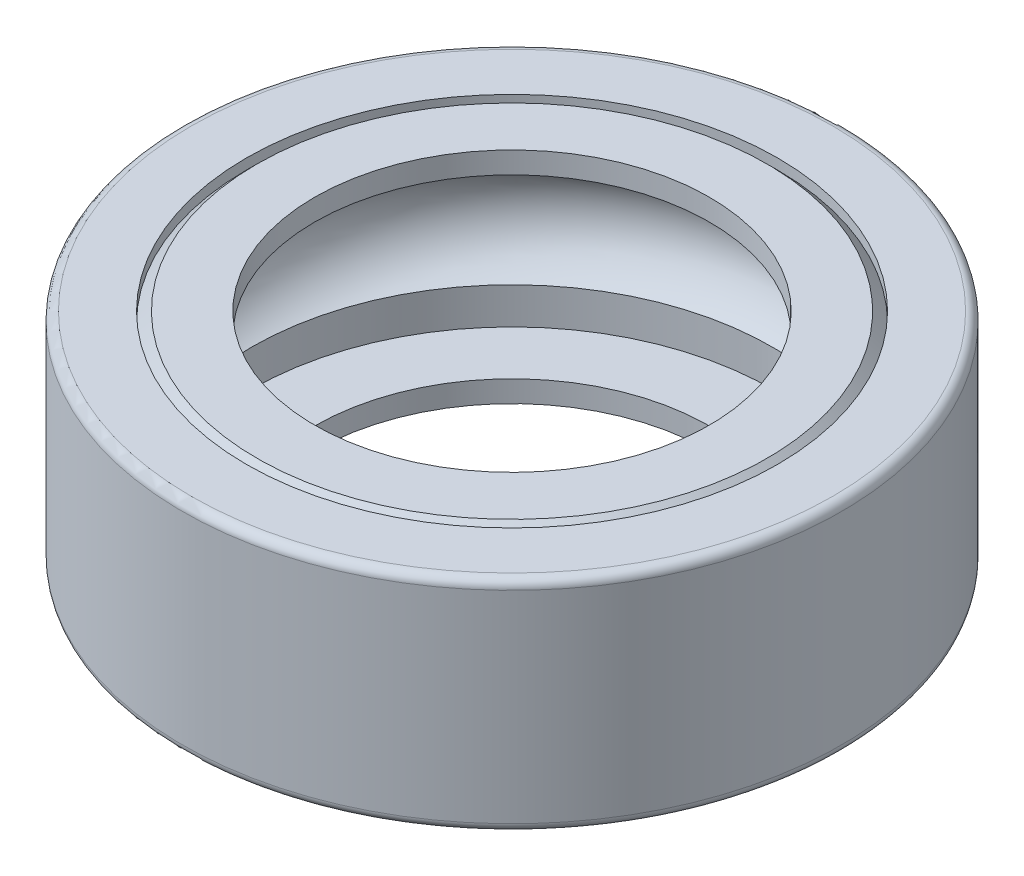
ISO-10303-21;
HEADER;
FILE_DESCRIPTION(('STEP AP214'),'2;1');
FILE_NAME('part.step','',(''),(''),'','','');
FILE_SCHEMA(('AUTOMOTIVE_DESIGN { 1 0 10303 214 1 1 1 1 }'));
ENDSEC;
DATA;
#1=APPLICATION_CONTEXT('core data for automotive mechanical design processes');
#2=APPLICATION_PROTOCOL_DEFINITION('international standard','automotive_design',2000,#1);
#3=PRODUCT_CONTEXT('',#1,'mechanical');
#4=PRODUCT('Part','Part','',(#3));
#5=PRODUCT_RELATED_PRODUCT_CATEGORY('part','',(#4));
#6=PRODUCT_DEFINITION_FORMATION('','',#4);
#7=PRODUCT_DEFINITION_CONTEXT('part definition',#1,'design');
#8=PRODUCT_DEFINITION('design','',#6,#7);
#9=PRODUCT_DEFINITION_SHAPE('','',#8);
#10=(LENGTH_UNIT() NAMED_UNIT(*) SI_UNIT(.MILLI.,.METRE.));
#11=(NAMED_UNIT(*) PLANE_ANGLE_UNIT() SI_UNIT($,.RADIAN.));
#12=(NAMED_UNIT(*) SI_UNIT($,.STERADIAN.) SOLID_ANGLE_UNIT());
#13=UNCERTAINTY_MEASURE_WITH_UNIT(LENGTH_MEASURE(1.E-05),#10,'distance_accuracy_value','');
#14=(GEOMETRIC_REPRESENTATION_CONTEXT(3) GLOBAL_UNCERTAINTY_ASSIGNED_CONTEXT((#13)) GLOBAL_UNIT_ASSIGNED_CONTEXT((#10,
#11,#12)) REPRESENTATION_CONTEXT('',''));
#15=CARTESIAN_POINT('',(0.,0.,0.));
#16=DIRECTION('',(0.,0.,1.));
#17=DIRECTION('',(1.,0.,0.));
#18=AXIS2_PLACEMENT_3D('',#15,#16,#17);
#19=CARTESIAN_POINT('',(6.04350000000431,-4.49999999995202,0.));
#20=DIRECTION('',(0.,-1.,0.));
#21=DIRECTION('',(1.,0.,0.));
#22=AXIS2_PLACEMENT_3D('',#19,#20,#21);
#23=PLANE('',#22);
#24=CARTESIAN_POINT('',(0.,-4.49999999995202,0.));
#25=DIRECTION('',(0.,1.,0.));
#26=DIRECTION('',(-1.,0.,0.));
#27=AXIS2_PLACEMENT_3D('',#24,#25,#26);
#28=CIRCLE('',#27,5.925);
#29=CARTESIAN_POINT('',(-5.925,-4.49999999995202,0.));
#30=VERTEX_POINT('',#29);
#31=EDGE_CURVE('E100',#30,#30,#28,.T.);
#32=ORIENTED_EDGE('',*,*,#31,.T.);
#33=EDGE_LOOP('',(#32));
#34=FACE_BOUND('',#33,.T.);
#35=CARTESIAN_POINT('',(0.,-4.49999999995202,0.));
#36=DIRECTION('',(0.,1.,0.));
#37=DIRECTION('',(-1.,0.,0.));
#38=AXIS2_PLACEMENT_3D('',#35,#36,#37);
#39=CIRCLE('',#38,6.04350000000431);
#40=CARTESIAN_POINT('',(-6.04350000000432,-4.49999999995202,0.));
#41=VERTEX_POINT('',#40);
#42=EDGE_CURVE('E10',#41,#41,#39,.T.);
#43=ORIENTED_EDGE('',*,*,#42,.F.);
#44=EDGE_LOOP('',(#43));
#45=FACE_BOUND('',#44,.T.);
#46=ADVANCED_FACE('F30',(#34,#45),#23,.T.);
#47=CARTESIAN_POINT('',(0.,-5.00125000192031,0.));
#48=DIRECTION('',(0.,1.,0.));
#49=DIRECTION('',(-1.,0.,0.));
#50=AXIS2_PLACEMENT_3D('',#47,#48,#49);
#51=CYLINDRICAL_SURFACE('',#50,6.04350000000431);
#52=ORIENTED_EDGE('',*,*,#42,.T.);
#53=EDGE_LOOP('',(#52));
#54=FACE_BOUND('',#53,.T.);
#55=CARTESIAN_POINT('',(0.,-4.50999999995202,0.));
#56=DIRECTION('',(0.,1.,0.));
#57=DIRECTION('',(-1.,0.,0.));
#58=AXIS2_PLACEMENT_3D('',#55,#56,#57);
#59=CIRCLE('',#58,6.04350000000431);
#60=CARTESIAN_POINT('',(-6.04350000000432,-4.50999999995202,0.));
#61=VERTEX_POINT('',#60);
#62=EDGE_CURVE('E36',#61,#61,#59,.T.);
#63=ORIENTED_EDGE('',*,*,#62,.F.);
#64=EDGE_LOOP('',(#63));
#65=FACE_BOUND('',#64,.T.);
#66=ADVANCED_FACE('F118',(#54,#65),#51,.F.);
#67=CARTESIAN_POINT('',(4.4935,-4.50999999995202,0.));
#68=DIRECTION('',(0.,1.,0.));
#69=DIRECTION('',(-1.,0.,0.));
#70=AXIS2_PLACEMENT_3D('',#67,#68,#69);
#71=PLANE('',#70);
#72=ORIENTED_EDGE('',*,*,#62,.T.);
#73=EDGE_LOOP('',(#72));
#74=FACE_BOUND('',#73,.T.);
#75=CARTESIAN_POINT('',(0.,-4.50999999995202,0.));
#76=DIRECTION('',(0.,1.,0.));
#77=DIRECTION('',(-1.,0.,0.));
#78=AXIS2_PLACEMENT_3D('',#75,#76,#77);
#79=CIRCLE('',#78,4.4935);
#80=CARTESIAN_POINT('',(-4.4935,-4.50999999995202,0.));
#81=VERTEX_POINT('',#80);
#82=EDGE_CURVE('E40',#81,#81,#79,.T.);
#83=ORIENTED_EDGE('',*,*,#82,.F.);
#84=EDGE_LOOP('',(#83));
#85=FACE_BOUND('',#84,.T.);
#86=ADVANCED_FACE('F122',(#74,#85),#71,.T.);
#87=CARTESIAN_POINT('',(0.,-5.00125000192031,0.));
#88=DIRECTION('',(0.,1.,0.));
#89=DIRECTION('',(-1.,0.,0.));
#90=AXIS2_PLACEMENT_3D('',#87,#88,#89);
#91=CYLINDRICAL_SURFACE('',#90,4.4935);
#92=ORIENTED_EDGE('',*,*,#82,.T.);
#93=EDGE_LOOP('',(#92));
#94=FACE_BOUND('',#93,.T.);
#95=CARTESIAN_POINT('',(0.,-5.,0.));
#96=DIRECTION('',(0.,1.,0.));
#97=DIRECTION('',(-1.,0.,0.));
#98=AXIS2_PLACEMENT_3D('',#95,#96,#97);
#99=CIRCLE('',#98,4.4935);
#100=CARTESIAN_POINT('',(-4.4935,-5.,0.));
#101=VERTEX_POINT('',#100);
#102=EDGE_CURVE('E44',#101,#101,#99,.T.);
#103=ORIENTED_EDGE('',*,*,#102,.F.);
#104=EDGE_LOOP('',(#103));
#105=FACE_BOUND('',#104,.T.);
#106=ADVANCED_FACE('F126',(#94,#105),#91,.F.);
#107=CARTESIAN_POINT('',(5.80349999995633,-5.,0.));
#108=DIRECTION('',(0.,-1.,0.));
#109=DIRECTION('',(1.,0.,0.));
#110=AXIS2_PLACEMENT_3D('',#107,#108,#109);
#111=PLANE('',#110);
#112=ORIENTED_EDGE('',*,*,#102,.T.);
#113=EDGE_LOOP('',(#112));
#114=FACE_BOUND('',#113,.T.);
#115=CARTESIAN_POINT('',(0.,-5.,0.));
#116=DIRECTION('',(0.,1.,0.));
#117=DIRECTION('',(-1.,0.,0.));
#118=AXIS2_PLACEMENT_3D('',#115,#116,#117);
#119=CIRCLE('',#118,5.80349999995633);
#120=CARTESIAN_POINT('',(-5.80349999995633,-5.,0.));
#121=VERTEX_POINT('',#120);
#122=EDGE_CURVE('E49',#121,#121,#119,.T.);
#123=ORIENTED_EDGE('',*,*,#122,.F.);
#124=EDGE_LOOP('',(#123));
#125=FACE_BOUND('',#124,.T.);
#126=ADVANCED_FACE('F132',(#114,#125),#111,.T.);
#127=CARTESIAN_POINT('',(0.,-4.75999999995202,0.));
#128=DIRECTION('',(0.,1.,0.));
#129=DIRECTION('',(-1.,0.,0.));
#130=AXIS2_PLACEMENT_3D('',#127,#128,#129);
#131=CONICAL_SURFACE('',#130,6.04350000000431,0.78539816339745);
#132=ORIENTED_EDGE('',*,*,#122,.T.);
#133=EDGE_LOOP('',(#132));
#134=FACE_BOUND('',#133,.T.);
#135=CARTESIAN_POINT('',(0.,-4.75999999995202,0.));
#136=DIRECTION('',(0.,1.,0.));
#137=DIRECTION('',(-1.,0.,0.));
#138=AXIS2_PLACEMENT_3D('',#135,#136,#137);
#139=CIRCLE('',#138,6.04350000000431);
#140=CARTESIAN_POINT('',(-6.04350000000432,-4.75999999995202,0.));
#141=VERTEX_POINT('',#140);
#142=EDGE_CURVE('E52',#141,#141,#139,.T.);
#143=ORIENTED_EDGE('',*,*,#142,.F.);
#144=EDGE_LOOP('',(#143));
#145=FACE_BOUND('',#144,.T.);
#146=ADVANCED_FACE('F136',(#134,#145),#131,.T.);
#147=CARTESIAN_POINT('',(0.,-5.00125000192031,0.));
#148=DIRECTION('',(0.,1.,0.));
#149=DIRECTION('',(-1.,0.,0.));
#150=AXIS2_PLACEMENT_3D('',#147,#148,#149);
#151=CYLINDRICAL_SURFACE('',#150,6.04350000000431);
#152=ORIENTED_EDGE('',*,*,#142,.T.);
#153=EDGE_LOOP('',(#152));
#154=FACE_BOUND('',#153,.T.);
#155=CARTESIAN_POINT('',(0.,-5.,0.));
#156=DIRECTION('',(0.,1.,0.));
#157=DIRECTION('',(-1.,0.,0.));
#158=AXIS2_PLACEMENT_3D('',#155,#156,#157);
#159=CIRCLE('',#158,6.04350000000431);
#160=CARTESIAN_POINT('',(-6.04350000000432,-5.,0.));
#161=VERTEX_POINT('',#160);
#162=EDGE_CURVE('E55',#161,#161,#159,.T.);
#163=ORIENTED_EDGE('',*,*,#162,.F.);
#164=EDGE_LOOP('',(#163));
#165=FACE_BOUND('',#164,.T.);
#166=ADVANCED_FACE('F140',(#154,#165),#151,.F.);
#167=CARTESIAN_POINT('',(7.3,-5.,0.));
#168=DIRECTION('',(0.,-1.,0.));
#169=DIRECTION('',(1.,0.,0.));
#170=AXIS2_PLACEMENT_3D('',#167,#168,#169);
#171=PLANE('',#170);
#172=ORIENTED_EDGE('',*,*,#162,.T.);
#173=EDGE_LOOP('',(#172));
#174=FACE_BOUND('',#173,.T.);
#175=CARTESIAN_POINT('',(0.,-5.,0.));
#176=DIRECTION('',(0.,1.,0.));
#177=DIRECTION('',(-1.,0.,0.));
#178=AXIS2_PLACEMENT_3D('',#175,#176,#177);
#179=CIRCLE('',#178,7.3);
#180=CARTESIAN_POINT('',(-7.3,-5.,0.));
#181=VERTEX_POINT('',#180);
#182=EDGE_CURVE('E58',#181,#181,#179,.T.);
#183=ORIENTED_EDGE('',*,*,#182,.F.);
#184=EDGE_LOOP('',(#183));
#185=FACE_BOUND('',#184,.T.);
#186=ADVANCED_FACE('F144',(#174,#185),#171,.T.);
#187=CARTESIAN_POINT('',(0.,-4.8,0.));
#188=DIRECTION('',(0.,1.,0.));
#189=DIRECTION('',(-1.,0.,0.));
#190=AXIS2_PLACEMENT_3D('',#187,#188,#189);
#191=TOROIDAL_SURFACE('',#190,7.3,0.200000000000001);
#192=ORIENTED_EDGE('',*,*,#182,.T.);
#193=EDGE_LOOP('',(#192));
#194=FACE_BOUND('',#193,.T.);
#195=CARTESIAN_POINT('',(0.,-4.8,0.));
#196=DIRECTION('',(0.,1.,0.));
#197=DIRECTION('',(-1.,0.,0.));
#198=AXIS2_PLACEMENT_3D('',#195,#196,#197);
#199=CIRCLE('',#198,7.5);
#200=CARTESIAN_POINT('',(-7.5,-4.79999999999999,0.));
#201=VERTEX_POINT('',#200);
#202=EDGE_CURVE('E61',#201,#201,#199,.T.);
#203=ORIENTED_EDGE('',*,*,#202,.F.);
#204=EDGE_LOOP('',(#203));
#205=FACE_BOUND('',#204,.T.);
#206=ADVANCED_FACE('F148',(#194,#205),#191,.T.);
#207=CARTESIAN_POINT('',(0.,-5.00125000192031,0.));
#208=DIRECTION('',(0.,1.,0.));
#209=DIRECTION('',(-1.,0.,0.));
#210=AXIS2_PLACEMENT_3D('',#207,#208,#209);
#211=CYLINDRICAL_SURFACE('',#210,7.5);
#212=ORIENTED_EDGE('',*,*,#202,.T.);
#213=EDGE_LOOP('',(#212));
#214=FACE_BOUND('',#213,.T.);
#215=CARTESIAN_POINT('',(0.,-0.199999999901764,0.));
#216=DIRECTION('',(0.,1.,0.));
#217=DIRECTION('',(-1.,0.,0.));
#218=AXIS2_PLACEMENT_3D('',#215,#216,#217);
#219=CIRCLE('',#218,7.5);
#220=CARTESIAN_POINT('',(-7.5,-0.199999999901763,0.));
#221=VERTEX_POINT('',#220);
#222=EDGE_CURVE('E64',#221,#221,#219,.T.);
#223=ORIENTED_EDGE('',*,*,#222,.F.);
#224=EDGE_LOOP('',(#223));
#225=FACE_BOUND('',#224,.T.);
#226=ADVANCED_FACE('F152',(#214,#225),#211,.T.);
#227=CARTESIAN_POINT('',(0.,-0.199999999901764,0.));
#228=DIRECTION('',(0.,1.,0.));
#229=DIRECTION('',(-1.,0.,0.));
#230=AXIS2_PLACEMENT_3D('',#227,#228,#229);
#231=TOROIDAL_SURFACE('',#230,7.3,0.200000000000001);
#232=ORIENTED_EDGE('',*,*,#222,.T.);
#233=EDGE_LOOP('',(#232));
#234=FACE_BOUND('',#233,.T.);
#235=CARTESIAN_POINT('',(0.,9.82365230828286E-11,0.));
#236=DIRECTION('',(0.,1.,0.));
#237=DIRECTION('',(-1.,0.,0.));
#238=AXIS2_PLACEMENT_3D('',#235,#236,#237);
#239=CIRCLE('',#238,7.3);
#240=CARTESIAN_POINT('',(-7.3,9.8237864026786E-11,0.));
#241=VERTEX_POINT('',#240);
#242=EDGE_CURVE('E67',#241,#241,#239,.T.);
#243=ORIENTED_EDGE('',*,*,#242,.F.);
#244=EDGE_LOOP('',(#243));
#245=FACE_BOUND('',#244,.T.);
#246=ADVANCED_FACE('F156',(#234,#245),#231,.T.);
#247=CARTESIAN_POINT('',(6.04350000000431,9.82352019187913E-11,0.));
#248=DIRECTION('',(0.,1.,0.));
#249=DIRECTION('',(-1.,0.,0.));
#250=AXIS2_PLACEMENT_3D('',#247,#248,#249);
#251=PLANE('',#250);
#252=ORIENTED_EDGE('',*,*,#242,.T.);
#253=EDGE_LOOP('',(#252));
#254=FACE_BOUND('',#253,.T.);
#255=CARTESIAN_POINT('',(0.,9.82356557210906E-11,0.));
#256=DIRECTION('',(0.,1.,0.));
#257=DIRECTION('',(-1.,0.,0.));
#258=AXIS2_PLACEMENT_3D('',#255,#256,#257);
#259=CIRCLE('',#258,6.04350000000431);
#260=CARTESIAN_POINT('',(-6.04350000000431,9.82367658573655E-11,0.));
#261=VERTEX_POINT('',#260);
#262=EDGE_CURVE('E70',#261,#261,#259,.T.);
#263=ORIENTED_EDGE('',*,*,#262,.F.);
#264=EDGE_LOOP('',(#263));
#265=FACE_BOUND('',#264,.T.);
#266=ADVANCED_FACE('F160',(#254,#265),#251,.T.);
#267=CARTESIAN_POINT('',(0.,-5.00125000192031,0.));
#268=DIRECTION('',(0.,1.,0.));
#269=DIRECTION('',(-1.,0.,0.));
#270=AXIS2_PLACEMENT_3D('',#267,#268,#269);
#271=CYLINDRICAL_SURFACE('',#270,6.04350000000431);
#272=ORIENTED_EDGE('',*,*,#262,.T.);
#273=EDGE_LOOP('',(#272));
#274=FACE_BOUND('',#273,.T.);
#275=CARTESIAN_POINT('',(0.,-0.239999999952019,0.));
#276=DIRECTION('',(0.,1.,0.));
#277=DIRECTION('',(-1.,0.,0.));
#278=AXIS2_PLACEMENT_3D('',#275,#276,#277);
#279=CIRCLE('',#278,6.04350000000431);
#280=CARTESIAN_POINT('',(-6.04350000000431,-0.239999999952018,0.));
#281=VERTEX_POINT('',#280);
#282=EDGE_CURVE('E73',#281,#281,#279,.T.);
#283=ORIENTED_EDGE('',*,*,#282,.F.);
#284=EDGE_LOOP('',(#283));
#285=FACE_BOUND('',#284,.T.);
#286=ADVANCED_FACE('F164',(#274,#285),#271,.F.);
#287=CARTESIAN_POINT('',(0.,9.82356557210906E-11,0.));
#288=DIRECTION('',(0.,-1.,0.));
#289=DIRECTION('',(1.,0.,0.));
#290=AXIS2_PLACEMENT_3D('',#287,#288,#289);
#291=CONICAL_SURFACE('',#290,5.80349999995406,0.785398163397452);
#292=ORIENTED_EDGE('',*,*,#282,.T.);
#293=EDGE_LOOP('',(#292));
#294=FACE_BOUND('',#293,.T.);
#295=CARTESIAN_POINT('',(0.,9.82356557210906E-11,0.));
#296=DIRECTION('',(0.,1.,0.));
#297=DIRECTION('',(-1.,0.,0.));
#298=AXIS2_PLACEMENT_3D('',#295,#296,#297);
#299=CIRCLE('',#298,5.80349999995406);
#300=CARTESIAN_POINT('',(-5.80349999995406,9.82367217715368E-11,0.));
#301=VERTEX_POINT('',#300);
#302=EDGE_CURVE('E76',#301,#301,#299,.T.);
#303=ORIENTED_EDGE('',*,*,#302,.F.);
#304=EDGE_LOOP('',(#303));
#305=FACE_BOUND('',#304,.T.);
#306=ADVANCED_FACE('F168',(#294,#305),#291,.T.);
#307=CARTESIAN_POINT('',(4.4935,9.82354103392009E-11,0.));
#308=DIRECTION('',(0.,1.,0.));
#309=DIRECTION('',(-1.,0.,0.));
#310=AXIS2_PLACEMENT_3D('',#307,#308,#309);
#311=PLANE('',#310);
#312=ORIENTED_EDGE('',*,*,#302,.T.);
#313=EDGE_LOOP('',(#312));
#314=FACE_BOUND('',#313,.T.);
#315=CARTESIAN_POINT('',(0.,9.82365230828286E-11,0.));
#316=DIRECTION('',(0.,1.,0.));
#317=DIRECTION('',(-1.,0.,0.));
#318=AXIS2_PLACEMENT_3D('',#315,#316,#317);
#319=CIRCLE('',#318,4.4935);
#320=CARTESIAN_POINT('',(-4.4935,9.82373484981262E-11,0.));
#321=VERTEX_POINT('',#320);
#322=EDGE_CURVE('E79',#321,#321,#319,.T.);
#323=ORIENTED_EDGE('',*,*,#322,.F.);
#324=EDGE_LOOP('',(#323));
#325=FACE_BOUND('',#324,.T.);
#326=ADVANCED_FACE('F172',(#314,#325),#311,.T.);
#327=CARTESIAN_POINT('',(0.,-5.00125000192031,0.));
#328=DIRECTION('',(0.,1.,0.));
#329=DIRECTION('',(-1.,0.,0.));
#330=AXIS2_PLACEMENT_3D('',#327,#328,#329);
#331=CYLINDRICAL_SURFACE('',#330,4.4935);
#332=ORIENTED_EDGE('',*,*,#322,.T.);
#333=EDGE_LOOP('',(#332));
#334=FACE_BOUND('',#333,.T.);
#335=CARTESIAN_POINT('',(0.,-0.489999999952023,0.));
#336=DIRECTION('',(0.,1.,0.));
#337=DIRECTION('',(-1.,0.,0.));
#338=AXIS2_PLACEMENT_3D('',#335,#336,#337);
#339=CIRCLE('',#338,4.4935);
#340=CARTESIAN_POINT('',(-4.4935,-0.489999999952022,0.));
#341=VERTEX_POINT('',#340);
#342=EDGE_CURVE('E82',#341,#341,#339,.T.);
#343=ORIENTED_EDGE('',*,*,#342,.F.);
#344=EDGE_LOOP('',(#343));
#345=FACE_BOUND('',#344,.T.);
#346=ADVANCED_FACE('F176',(#334,#345),#331,.F.);
#347=CARTESIAN_POINT('',(6.04350000000431,-0.489999999952024,0.));
#348=DIRECTION('',(0.,-1.,0.));
#349=DIRECTION('',(1.,0.,0.));
#350=AXIS2_PLACEMENT_3D('',#347,#348,#349);
#351=PLANE('',#350);
#352=ORIENTED_EDGE('',*,*,#342,.T.);
#353=EDGE_LOOP('',(#352));
#354=FACE_BOUND('',#353,.T.);
#355=CARTESIAN_POINT('',(0.,-0.489999999952023,0.));
#356=DIRECTION('',(0.,1.,0.));
#357=DIRECTION('',(-1.,0.,0.));
#358=AXIS2_PLACEMENT_3D('',#355,#356,#357);
#359=CIRCLE('',#358,6.04350000000431);
#360=CARTESIAN_POINT('',(-6.04350000000431,-0.489999999952022,0.));
#361=VERTEX_POINT('',#360);
#362=EDGE_CURVE('E85',#361,#361,#359,.T.);
#363=ORIENTED_EDGE('',*,*,#362,.F.);
#364=EDGE_LOOP('',(#363));
#365=FACE_BOUND('',#364,.T.);
#366=ADVANCED_FACE('F180',(#354,#365),#351,.T.);
#367=CARTESIAN_POINT('',(0.,-5.00125000192031,0.));
#368=DIRECTION('',(0.,1.,0.));
#369=DIRECTION('',(-1.,0.,0.));
#370=AXIS2_PLACEMENT_3D('',#367,#368,#369);
#371=CYLINDRICAL_SURFACE('',#370,6.04350000000431);
#372=ORIENTED_EDGE('',*,*,#362,.T.);
#373=EDGE_LOOP('',(#372));
#374=FACE_BOUND('',#373,.T.);
#375=CARTESIAN_POINT('',(0.,-0.49999999995202,0.));
#376=DIRECTION('',(0.,1.,0.));
#377=DIRECTION('',(-1.,0.,0.));
#378=AXIS2_PLACEMENT_3D('',#375,#376,#377);
#379=CIRCLE('',#378,6.04350000000431);
#380=CARTESIAN_POINT('',(-6.04350000000431,-0.499999999952019,0.));
#381=VERTEX_POINT('',#380);
#382=EDGE_CURVE('E88',#381,#381,#379,.T.);
#383=ORIENTED_EDGE('',*,*,#382,.F.);
#384=EDGE_LOOP('',(#383));
#385=FACE_BOUND('',#384,.T.);
#386=ADVANCED_FACE('F184',(#374,#385),#371,.F.);
#387=CARTESIAN_POINT('',(5.925,-0.49999999995202,0.));
#388=DIRECTION('',(0.,1.,0.));
#389=DIRECTION('',(-1.,0.,0.));
#390=AXIS2_PLACEMENT_3D('',#387,#388,#389);
#391=PLANE('',#390);
#392=ORIENTED_EDGE('',*,*,#382,.T.);
#393=EDGE_LOOP('',(#392));
#394=FACE_BOUND('',#393,.T.);
#395=CARTESIAN_POINT('',(0.,-0.49999999995202,0.));
#396=DIRECTION('',(0.,1.,0.));
#397=DIRECTION('',(-1.,0.,0.));
#398=AXIS2_PLACEMENT_3D('',#395,#396,#397);
#399=CIRCLE('',#398,5.925);
#400=CARTESIAN_POINT('',(-5.925,-0.499999999952019,0.));
#401=VERTEX_POINT('',#400);
#402=EDGE_CURVE('E91',#401,#401,#399,.T.);
#403=ORIENTED_EDGE('',*,*,#402,.F.);
#404=EDGE_LOOP('',(#403));
#405=FACE_BOUND('',#404,.T.);
#406=ADVANCED_FACE('F188',(#394,#405),#391,.T.);
#407=CARTESIAN_POINT('',(0.,-5.00125000192031,0.));
#408=DIRECTION('',(0.,1.,0.));
#409=DIRECTION('',(-1.,0.,0.));
#410=AXIS2_PLACEMENT_3D('',#407,#408,#409);
#411=CYLINDRICAL_SURFACE('',#410,5.925);
#412=ORIENTED_EDGE('',*,*,#402,.T.);
#413=EDGE_LOOP('',(#412));
#414=FACE_BOUND('',#413,.T.);
#415=CARTESIAN_POINT('',(0.,-1.33086570489101,0.));
#416=DIRECTION('',(0.,1.,0.));
#417=DIRECTION('',(-1.,0.,0.));
#418=AXIS2_PLACEMENT_3D('',#415,#416,#417);
#419=CIRCLE('',#418,5.925);
#420=CARTESIAN_POINT('',(-5.925,-1.33086570489101,0.));
#421=VERTEX_POINT('',#420);
#422=EDGE_CURVE('E94',#421,#421,#419,.T.);
#423=ORIENTED_EDGE('',*,*,#422,.F.);
#424=EDGE_LOOP('',(#423));
#425=FACE_BOUND('',#424,.T.);
#426=ADVANCED_FACE('F114',(#414,#425),#411,.F.);
#427=CARTESIAN_POINT('',(0.,-2.5,0.));
#428=DIRECTION('',(0.,1.,0.));
#429=DIRECTION('',(-1.,0.,0.));
#430=AXIS2_PLACEMENT_3D('',#427,#428,#429);
#431=TOROIDAL_SURFACE('',#430,5.25,1.35);
#432=ORIENTED_EDGE('',*,*,#422,.T.);
#433=EDGE_LOOP('',(#432));
#434=FACE_BOUND('',#433,.T.);
#435=CARTESIAN_POINT('',(0.,-3.66913429510899,0.));
#436=DIRECTION('',(0.,1.,0.));
#437=DIRECTION('',(-1.,0.,0.));
#438=AXIS2_PLACEMENT_3D('',#435,#436,#437);
#439=CIRCLE('',#438,5.925);
#440=CARTESIAN_POINT('',(-5.925,-3.66913429510899,0.));
#441=VERTEX_POINT('',#440);
#442=EDGE_CURVE('E97',#441,#441,#439,.T.);
#443=ORIENTED_EDGE('',*,*,#442,.F.);
#444=EDGE_LOOP('',(#443));
#445=FACE_BOUND('',#444,.T.);
#446=ADVANCED_FACE('F108',(#434,#445),#431,.F.);
#447=CARTESIAN_POINT('',(0.,-5.00125000192031,0.));
#448=DIRECTION('',(0.,1.,0.));
#449=DIRECTION('',(-1.,0.,0.));
#450=AXIS2_PLACEMENT_3D('',#447,#448,#449);
#451=CYLINDRICAL_SURFACE('',#450,5.925);
#452=ORIENTED_EDGE('',*,*,#442,.T.);
#453=EDGE_LOOP('',(#452));
#454=FACE_BOUND('',#453,.T.);
#455=ORIENTED_EDGE('',*,*,#31,.F.);
#456=EDGE_LOOP('',(#455));
#457=FACE_BOUND('',#456,.T.);
#458=ADVANCED_FACE('F106',(#454,#457),#451,.F.);
#459=CLOSED_SHELL('',(#46,#66,#86,#106,#126,#146,#166,#186,#206,#226,#246,#266,#286,#306,#326,
#346,#366,#386,#406,#426,#446,#458));
#460=MANIFOLD_SOLID_BREP('B2',#459);
#461=ADVANCED_BREP_SHAPE_REPRESENTATION('',(#18,#460),#14);
#462=SHAPE_DEFINITION_REPRESENTATION(#9,#461);
ENDSEC;
END-ISO-10303-21;
